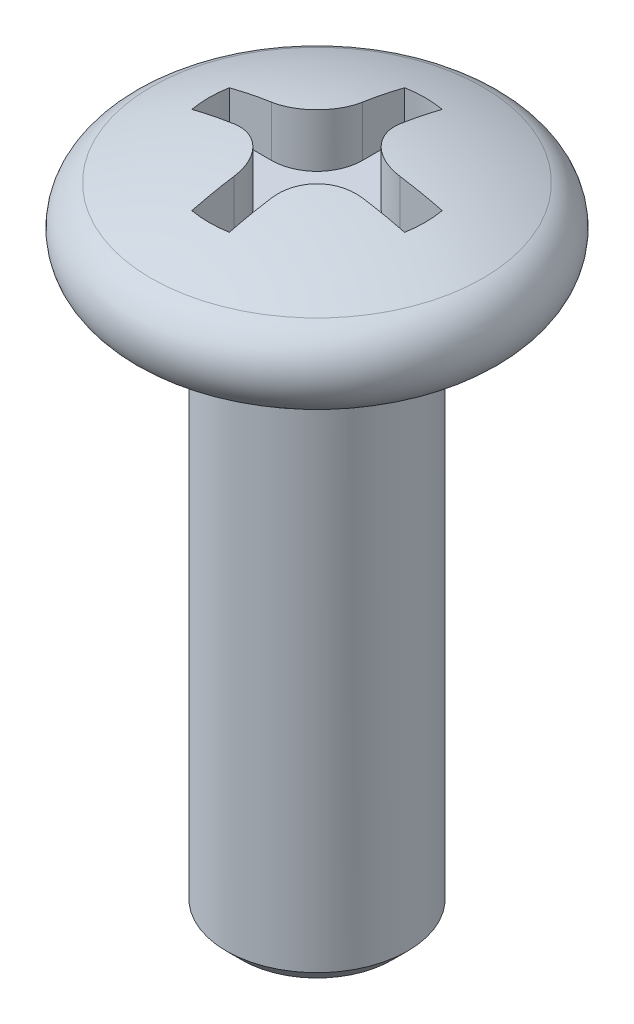
ISO-10303-21;
HEADER;
FILE_DESCRIPTION(('STEP AP214'),'2;1');
FILE_NAME('part.step','',(''),(''),'','','');
FILE_SCHEMA(('AUTOMOTIVE_DESIGN { 1 0 10303 214 1 1 1 1 }'));
ENDSEC;
DATA;
#1=APPLICATION_CONTEXT('core data for automotive mechanical design processes');
#2=APPLICATION_PROTOCOL_DEFINITION('international standard','automotive_design',2000,#1);
#3=PRODUCT_CONTEXT('',#1,'mechanical');
#4=PRODUCT('Part','Part','',(#3));
#5=PRODUCT_RELATED_PRODUCT_CATEGORY('part','',(#4));
#6=PRODUCT_DEFINITION_FORMATION('','',#4);
#7=PRODUCT_DEFINITION_CONTEXT('part definition',#1,'design');
#8=PRODUCT_DEFINITION('design','',#6,#7);
#9=PRODUCT_DEFINITION_SHAPE('','',#8);
#10=(LENGTH_UNIT() NAMED_UNIT(*) SI_UNIT(.MILLI.,.METRE.));
#11=(NAMED_UNIT(*) PLANE_ANGLE_UNIT() SI_UNIT($,.RADIAN.));
#12=(NAMED_UNIT(*) SI_UNIT($,.STERADIAN.) SOLID_ANGLE_UNIT());
#13=UNCERTAINTY_MEASURE_WITH_UNIT(LENGTH_MEASURE(1.E-05),#10,'distance_accuracy_value','');
#14=(GEOMETRIC_REPRESENTATION_CONTEXT(3) GLOBAL_UNCERTAINTY_ASSIGNED_CONTEXT((#13)) GLOBAL_UNIT_ASSIGNED_CONTEXT((#10,
#11,#12)) REPRESENTATION_CONTEXT('',''));
#15=CARTESIAN_POINT('',(0.,0.,0.));
#16=DIRECTION('',(0.,0.,1.));
#17=DIRECTION('',(1.,0.,0.));
#18=AXIS2_PLACEMENT_3D('',#15,#16,#17);
#19=CARTESIAN_POINT('',(0.,0.8,0.));
#20=DIRECTION('',(0.,-1.,0.));
#21=DIRECTION('',(0.,0.,-1.));
#22=AXIS2_PLACEMENT_3D('',#19,#20,#21);
#23=PLANE('',#22);
#24=DIRECTION('',(0.,0.,1.));
#25=VECTOR('',#24,1.);
#26=CARTESIAN_POINT('',(-0.2692388155425,0.8,1.526437178598));
#27=LINE('',#26,#25);
#28=CARTESIAN_POINT('',(-0.2692388155425,0.8,0.9192388155425));
#29=VERTEX_POINT('',#28);
#30=CARTESIAN_POINT('',(-0.2692388155425,0.8,1.52643732965034));
#31=VERTEX_POINT('',#30);
#32=EDGE_CURVE('E160',#29,#31,#27,.T.);
#33=ORIENTED_EDGE('',*,*,#32,.T.);
#34=CARTESIAN_POINT('',(0.,0.8,0.));
#35=DIRECTION('',(0.,-1.,0.));
#36=DIRECTION('',(0.,0.,-1.));
#37=AXIS2_PLACEMENT_3D('',#34,#35,#36);
#38=CIRCLE('',#37,1.55);
#39=CARTESIAN_POINT('',(0.269238815542473,0.8,1.52643717859769));
#40=VERTEX_POINT('',#39);
#41=EDGE_CURVE('E239',#31,#40,#38,.F.);
#42=ORIENTED_EDGE('',*,*,#41,.T.);
#43=DIRECTION('',(0.,0.,-1.));
#44=VECTOR('',#43,1.);
#45=CARTESIAN_POINT('',(0.2692388155425,0.8,0.9192388155425));
#46=LINE('',#45,#44);
#47=CARTESIAN_POINT('',(0.2692388155425,0.8,0.9192388155425));
#48=VERTEX_POINT('',#47);
#49=EDGE_CURVE('E164',#40,#48,#46,.T.);
#50=ORIENTED_EDGE('',*,*,#49,.T.);
#51=CARTESIAN_POINT('',(0.9192388155425,0.8,0.9192388155425));
#52=DIRECTION('',(0.,-1.,0.));
#53=DIRECTION('',(0.,0.,-1.));
#54=AXIS2_PLACEMENT_3D('',#51,#52,#53);
#55=CIRCLE('',#54,0.65);
#56=CARTESIAN_POINT('',(0.9192388155425,0.8,0.2692388155425));
#57=VERTEX_POINT('',#56);
#58=EDGE_CURVE('E167',#57,#48,#55,.F.);
#59=ORIENTED_EDGE('',*,*,#58,.F.);
#60=DIRECTION('',(1.,0.,0.));
#61=VECTOR('',#60,1.);
#62=CARTESIAN_POINT('',(1.526437178598,0.8,0.2692388155425));
#63=LINE('',#62,#61);
#64=CARTESIAN_POINT('',(1.52643725449384,0.8,0.2692388155425));
#65=VERTEX_POINT('',#64);
#66=EDGE_CURVE('E168',#57,#65,#63,.T.);
#67=ORIENTED_EDGE('',*,*,#66,.T.);
#68=CARTESIAN_POINT('',(0.,0.8,0.));
#69=DIRECTION('',(0.,-1.,0.));
#70=DIRECTION('',(0.,0.,-1.));
#71=AXIS2_PLACEMENT_3D('',#68,#69,#70);
#72=CIRCLE('',#71,1.55);
#73=CARTESIAN_POINT('',(1.52643717859769,0.8,-0.269238815542473));
#74=VERTEX_POINT('',#73);
#75=EDGE_CURVE('E250',#65,#74,#72,.F.);
#76=ORIENTED_EDGE('',*,*,#75,.T.);
#77=DIRECTION('',(-1.,0.,0.));
#78=VECTOR('',#77,1.);
#79=CARTESIAN_POINT('',(0.9192388155425,0.8,-0.2692388155425));
#80=LINE('',#79,#78);
#81=CARTESIAN_POINT('',(0.9192388155425,0.8,-0.2692388155425));
#82=VERTEX_POINT('',#81);
#83=EDGE_CURVE('E173',#74,#82,#80,.T.);
#84=ORIENTED_EDGE('',*,*,#83,.T.);
#85=CARTESIAN_POINT('',(0.9192388155425,0.8,-0.9192388155425));
#86=DIRECTION('',(0.,-1.,0.));
#87=DIRECTION('',(0.,0.,-1.));
#88=AXIS2_PLACEMENT_3D('',#85,#86,#87);
#89=CIRCLE('',#88,0.65);
#90=CARTESIAN_POINT('',(0.2692388155425,0.8,-0.9192388155425));
#91=VERTEX_POINT('',#90);
#92=EDGE_CURVE('E176',#91,#82,#89,.F.);
#93=ORIENTED_EDGE('',*,*,#92,.F.);
#94=DIRECTION('',(0.,0.,-1.));
#95=VECTOR('',#94,1.);
#96=CARTESIAN_POINT('',(0.2692388155425,0.8,-1.526437178598));
#97=LINE('',#96,#95);
#98=CARTESIAN_POINT('',(0.2692388155425,0.8,-1.52643732965034));
#99=VERTEX_POINT('',#98);
#100=EDGE_CURVE('E178',#91,#99,#97,.T.);
#101=ORIENTED_EDGE('',*,*,#100,.T.);
#102=CARTESIAN_POINT('',(0.,0.8,0.));
#103=DIRECTION('',(0.,-1.,0.));
#104=DIRECTION('',(0.,0.,-1.));
#105=AXIS2_PLACEMENT_3D('',#102,#103,#104);
#106=CIRCLE('',#105,1.55);
#107=CARTESIAN_POINT('',(-0.269238815542474,0.8,-1.52643717859769));
#108=VERTEX_POINT('',#107);
#109=EDGE_CURVE('E136',#99,#108,#106,.F.);
#110=ORIENTED_EDGE('',*,*,#109,.T.);
#111=DIRECTION('',(0.,0.,1.));
#112=VECTOR('',#111,1.);
#113=CARTESIAN_POINT('',(-0.2692388155425,0.8,-0.9192388155425));
#114=LINE('',#113,#112);
#115=CARTESIAN_POINT('',(-0.2692388155425,0.8,-0.9192388155425));
#116=VERTEX_POINT('',#115);
#117=EDGE_CURVE('E132',#108,#116,#114,.T.);
#118=ORIENTED_EDGE('',*,*,#117,.T.);
#119=CARTESIAN_POINT('',(-0.9192388155425,0.8,-0.9192388155425));
#120=DIRECTION('',(0.,-1.,0.));
#121=DIRECTION('',(0.,0.,-1.));
#122=AXIS2_PLACEMENT_3D('',#119,#120,#121);
#123=CIRCLE('',#122,0.65);
#124=CARTESIAN_POINT('',(-0.9192388155425,0.8,-0.2692388155425));
#125=VERTEX_POINT('',#124);
#126=EDGE_CURVE('E19',#125,#116,#123,.F.);
#127=ORIENTED_EDGE('',*,*,#126,.F.);
#128=DIRECTION('',(-1.,0.,0.));
#129=VECTOR('',#128,1.);
#130=CARTESIAN_POINT('',(-1.526437178598,0.8,-0.2692388155425));
#131=LINE('',#130,#129);
#132=CARTESIAN_POINT('',(-1.5264371785977,0.8,-0.269238815542425));
#133=VERTEX_POINT('',#132);
#134=EDGE_CURVE('E127',#125,#133,#131,.T.);
#135=ORIENTED_EDGE('',*,*,#134,.T.);
#136=CARTESIAN_POINT('',(0.,0.8,0.));
#137=DIRECTION('',(0.,-1.,0.));
#138=DIRECTION('',(0.,0.,-1.));
#139=AXIS2_PLACEMENT_3D('',#136,#137,#138);
#140=CIRCLE('',#139,1.55);
#141=CARTESIAN_POINT('',(-1.52643717859784,0.8,0.2692388155425));
#142=VERTEX_POINT('',#141);
#143=EDGE_CURVE('E247',#133,#142,#140,.F.);
#144=ORIENTED_EDGE('',*,*,#143,.T.);
#145=DIRECTION('',(1.,0.,0.));
#146=VECTOR('',#145,1.);
#147=CARTESIAN_POINT('',(-0.9192388155425,0.8,0.2692388155425));
#148=LINE('',#147,#146);
#149=CARTESIAN_POINT('',(-0.9192388155425,0.8,0.2692388155425));
#150=VERTEX_POINT('',#149);
#151=EDGE_CURVE('E157',#142,#150,#148,.T.);
#152=ORIENTED_EDGE('',*,*,#151,.T.);
#153=CARTESIAN_POINT('',(-0.9192388155425,0.8,0.9192388155425));
#154=DIRECTION('',(0.,-1.,0.));
#155=DIRECTION('',(0.,0.,-1.));
#156=AXIS2_PLACEMENT_3D('',#153,#154,#155);
#157=CIRCLE('',#156,0.65);
#158=EDGE_CURVE('E233',#29,#150,#157,.F.);
#159=ORIENTED_EDGE('',*,*,#158,.F.);
#160=EDGE_LOOP('',(#33,#42,#50,#59,#67,#76,#84,#93,#101,#110,#118,#127,#135,#144,#152,#159));
#161=FACE_BOUND('',#160,.T.);
#162=ADVANCED_FACE('F16',(#161),#23,.F.);
#163=CARTESIAN_POINT('',(-1.526437178598,0.8,-0.2692388155425));
#164=DIRECTION('',(0.,0.,-1.));
#165=DIRECTION('',(-1.,0.,0.));
#166=AXIS2_PLACEMENT_3D('',#163,#164,#165);
#167=PLANE('',#166);
#168=ORIENTED_EDGE('',*,*,#134,.F.);
#169=DIRECTION('',(0.,-1.,0.));
#170=VECTOR('',#169,1.);
#171=CARTESIAN_POINT('',(-0.9192388155425,0.8,-0.2692388155425));
#172=LINE('',#171,#170);
#173=CARTESIAN_POINT('',(-0.919238815542485,1.5247137721749,-0.269238815542501));
#174=VERTEX_POINT('',#173);
#175=EDGE_CURVE('E146',#174,#125,#172,.T.);
#176=ORIENTED_EDGE('',*,*,#175,.F.);
#177=CARTESIAN_POINT('',(-1.52643717859785,1.40083405534686,-0.269238815542502));
#178=CARTESIAN_POINT('',(-1.42628258533272,1.42660341497324,-0.269238815542501));
#179=CARTESIAN_POINT('',(-1.32560542511221,1.44981140452209,-0.2692388155425));
#180=CARTESIAN_POINT('',(-1.12320597076041,1.49110464346474,-0.2692388155425));
#181=CARTESIAN_POINT('',(-1.02148367662913,1.50918989285854,-0.269238815542501));
#182=CARTESIAN_POINT('',(-0.919238815542471,1.52471377217481,-0.269238815542503));
#183=B_SPLINE_CURVE_WITH_KNOTS('',3,(#177,#178,#179,#180,#181,#182),.UNSPECIFIED.,.F.,.F.,(4,2,
4),(0.,0.309952435577942,0.619904871155884),.UNSPECIFIED.);
#184=CARTESIAN_POINT('',(-1.52643717859778,1.40083405534693,-0.269238815542426));
#185=VERTEX_POINT('',#184);
#186=EDGE_CURVE('E230',#185,#174,#183,.T.);
#187=ORIENTED_EDGE('',*,*,#186,.F.);
#188=DIRECTION('',(0.,-1.,0.));
#189=VECTOR('',#188,1.);
#190=CARTESIAN_POINT('',(-1.52643717859772,0.8,-0.269238815542349));
#191=LINE('',#190,#189);
#192=EDGE_CURVE('E245',#185,#133,#191,.T.);
#193=ORIENTED_EDGE('',*,*,#192,.T.);
#194=EDGE_LOOP('',(#168,#176,#187,#193));
#195=FACE_BOUND('',#194,.T.);
#196=ADVANCED_FACE('F290',(#195),#167,.F.);
#197=CARTESIAN_POINT('',(-0.9192388155425,0.8,-0.9192388155425));
#198=DIRECTION('',(0.,-1.,0.));
#199=DIRECTION('',(0.,0.,-1.));
#200=AXIS2_PLACEMENT_3D('',#197,#198,#199);
#201=CYLINDRICAL_SURFACE('',#200,0.65);
#202=DIRECTION('',(0.,1.,0.));
#203=VECTOR('',#202,1.);
#204=CARTESIAN_POINT('',(-0.2692388155425,0.8,-0.9192388155425));
#205=LINE('',#204,#203);
#206=CARTESIAN_POINT('',(-0.269238815542499,1.5247137721749,-0.9192388155425));
#207=VERTEX_POINT('',#206);
#208=EDGE_CURVE('E140',#116,#207,#205,.T.);
#209=ORIENTED_EDGE('',*,*,#208,.T.);
#210=CARTESIAN_POINT('',(-0.919238815542471,1.52471377217481,-0.269238815542502));
#211=CARTESIAN_POINT('',(-0.883271069284547,1.53017838215662,-0.269206596368221));
#212=CARTESIAN_POINT('',(-0.847230957030022,1.53518398680924,-0.272222835690411));
#213=CARTESIAN_POINT('',(-0.776024482266567,1.54415362187526,-0.284194183766013));
#214=CARTESIAN_POINT('',(-0.740857976412674,1.5481178242021,-0.293148311438722));
#215=CARTESIAN_POINT('',(-0.67237147630745,1.55488625546089,-0.316848960302737));
#216=CARTESIAN_POINT('',(-0.639053304502208,1.55768935656103,-0.331601086387425));
#217=CARTESIAN_POINT('',(-0.575297778798748,1.56204492956572,-0.366496760027211));
#218=CARTESIAN_POINT('',(-0.544859240050173,1.56359791783258,-0.386638076978003));
#219=CARTESIAN_POINT('',(-0.488097063461274,1.56539571440067,-0.431479043245953));
#220=CARTESIAN_POINT('',(-0.46172860298219,1.56565593228317,-0.456121349806758));
#221=CARTESIAN_POINT('',(-0.413435525795813,1.56490196217992,-0.509414647326526));
#222=CARTESIAN_POINT('',(-0.391510799474461,1.56388780563375,-0.538065539375813));
#223=CARTESIAN_POINT('',(-0.352825154531402,1.56062536432746,-0.598376464130783));
#224=CARTESIAN_POINT('',(-0.33603703253758,1.55838376285363,-0.630019440211363));
#225=CARTESIAN_POINT('',(-0.307904881496572,1.55273696196925,-0.69554063304805));
#226=CARTESIAN_POINT('',(-0.296559537832556,1.54933204387991,-0.729418307797173));
#227=CARTESIAN_POINT('',(-0.281799832125994,1.54249219211062,-0.789390970708275));
#228=CARTESIAN_POINT('',(-0.277087023520738,1.53929822937966,-0.815202930682549));
#229=CARTESIAN_POINT('',(-0.270805742102409,1.53238664939424,-0.867099473917435));
#230=CARTESIAN_POINT('',(-0.269232761212042,1.52866979112439,-0.893183612184108));
#231=CARTESIAN_POINT('',(-0.269238815542499,1.5247137721748,-0.919238815542471));
#232=B_SPLINE_CURVE_WITH_KNOTS('',3,(#210,#211,#212,#213,#214,#215,#216,#217,#218,#219,#220,
#221,#222,#223,#224,#225,#226,#227,#228,#229,#230,#231),.UNSPECIFIED.,.F.,.F.,(4,2,2,2,2,2,2,2,
2,2,4),(0.,0.109017930799935,0.218017853725243,0.327123406477721,0.436183869743588,
0.543941180487167,0.651695832846214,0.758869525629321,0.866017319256542,0.945129051904781,
1.02412711619082),.UNSPECIFIED.);
#233=EDGE_CURVE('E272',#174,#207,#232,.T.);
#234=ORIENTED_EDGE('',*,*,#233,.F.);
#235=ORIENTED_EDGE('',*,*,#175,.T.);
#236=ORIENTED_EDGE('',*,*,#126,.T.);
#237=EDGE_LOOP('',(#209,#234,#235,#236));
#238=FACE_BOUND('',#237,.T.);
#239=ADVANCED_FACE('F143',(#238),#201,.T.);
#240=CARTESIAN_POINT('',(-0.2692388155425,0.8,-0.9192388155425));
#241=DIRECTION('',(-1.,0.,0.));
#242=DIRECTION('',(0.,0.,1.));
#243=AXIS2_PLACEMENT_3D('',#240,#241,#242);
#244=PLANE('',#243);
#245=ORIENTED_EDGE('',*,*,#117,.F.);
#246=DIRECTION('',(0.,-1.,0.));
#247=VECTOR('',#246,1.);
#248=CARTESIAN_POINT('',(-0.269238815542447,0.8,-1.5264371785977));
#249=LINE('',#248,#247);
#250=CARTESIAN_POINT('',(-0.269238815542499,1.40083405534695,-1.5264371785976));
#251=VERTEX_POINT('',#250);
#252=EDGE_CURVE('E152',#108,#251,#249,.F.);
#253=ORIENTED_EDGE('',*,*,#252,.T.);
#254=CARTESIAN_POINT('',(-0.269238815542499,-4.530985590341,0.));
#255=DIRECTION('',(-1.,0.,0.));
#256=DIRECTION('',(0.,0.,1.));
#257=AXIS2_PLACEMENT_3D('',#254,#255,#256);
#258=CIRCLE('',#257,6.12507100115372);
#259=EDGE_CURVE('E149',#207,#251,#258,.T.);
#260=ORIENTED_EDGE('',*,*,#259,.F.);
#261=ORIENTED_EDGE('',*,*,#208,.F.);
#262=EDGE_LOOP('',(#245,#253,#260,#261));
#263=FACE_BOUND('',#262,.T.);
#264=ADVANCED_FACE('F147',(#263),#244,.F.);
#265=CARTESIAN_POINT('',(0.,0.8,0.));
#266=DIRECTION('',(0.,-1.,0.));
#267=DIRECTION('',(0.,0.,-1.));
#268=AXIS2_PLACEMENT_3D('',#265,#266,#267);
#269=CYLINDRICAL_SURFACE('',#268,1.55);
#270=ORIENTED_EDGE('',*,*,#109,.F.);
#271=DIRECTION('',(0.,1.,0.));
#272=VECTOR('',#271,1.);
#273=CARTESIAN_POINT('',(0.2692388155425,0.8,-1.526437480703));
#274=LINE('',#273,#272);
#275=CARTESIAN_POINT('',(0.2692388155425,1.40083401647652,-1.52643732965025));
#276=VERTEX_POINT('',#275);
#277=EDGE_CURVE('E179',#99,#276,#274,.T.);
#278=ORIENTED_EDGE('',*,*,#277,.T.);
#279=CARTESIAN_POINT('',(0.,1.400834055347,0.));
#280=DIRECTION('',(0.,-1.,0.));
#281=DIRECTION('',(0.,0.,-1.));
#282=AXIS2_PLACEMENT_3D('',#279,#280,#281);
#283=CIRCLE('',#282,1.55);
#284=EDGE_CURVE('E260',#251,#276,#283,.T.);
#285=ORIENTED_EDGE('',*,*,#284,.F.);
#286=ORIENTED_EDGE('',*,*,#252,.F.);
#287=EDGE_LOOP('',(#270,#278,#285,#286));
#288=FACE_BOUND('',#287,.T.);
#289=ADVANCED_FACE('F258',(#288),#269,.F.);
#290=CARTESIAN_POINT('',(0.2692388155425,0.8,-1.526437178598));
#291=DIRECTION('',(1.,0.,0.));
#292=DIRECTION('',(0.,0.,-1.));
#293=AXIS2_PLACEMENT_3D('',#290,#291,#292);
#294=PLANE('',#293);
#295=ORIENTED_EDGE('',*,*,#100,.F.);
#296=DIRECTION('',(0.,-1.,0.));
#297=VECTOR('',#296,1.);
#298=CARTESIAN_POINT('',(0.2692388155425,0.8,-0.9192388155425));
#299=LINE('',#298,#297);
#300=CARTESIAN_POINT('',(0.2692388155425,1.5247137721749,-0.9192388155425));
#301=VERTEX_POINT('',#300);
#302=EDGE_CURVE('E252',#301,#91,#299,.T.);
#303=ORIENTED_EDGE('',*,*,#302,.F.);
#304=CARTESIAN_POINT('',(0.2692388155425,-4.530985590341,0.));
#305=DIRECTION('',(-1.,0.,0.));
#306=DIRECTION('',(0.,0.,1.));
#307=AXIS2_PLACEMENT_3D('',#304,#305,#306);
#308=CIRCLE('',#307,6.12507100115372);
#309=EDGE_CURVE('E263',#276,#301,#308,.F.);
#310=ORIENTED_EDGE('',*,*,#309,.F.);
#311=ORIENTED_EDGE('',*,*,#277,.F.);
#312=EDGE_LOOP('',(#295,#303,#310,#311));
#313=FACE_BOUND('',#312,.T.);
#314=ADVANCED_FACE('F264',(#313),#294,.F.);
#315=CARTESIAN_POINT('',(0.9192388155425,0.8,-0.9192388155425));
#316=DIRECTION('',(0.,-1.,0.));
#317=DIRECTION('',(0.,0.,-1.));
#318=AXIS2_PLACEMENT_3D('',#315,#316,#317);
#319=CYLINDRICAL_SURFACE('',#318,0.65);
#320=DIRECTION('',(0.,1.,0.));
#321=VECTOR('',#320,1.);
#322=CARTESIAN_POINT('',(0.9192388155425,0.8,-0.2692388155425));
#323=LINE('',#322,#321);
#324=CARTESIAN_POINT('',(0.919238815542485,1.5247137721749,-0.269238815542501));
#325=VERTEX_POINT('',#324);
#326=EDGE_CURVE('E175',#82,#325,#323,.T.);
#327=ORIENTED_EDGE('',*,*,#326,.T.);
#328=CARTESIAN_POINT('',(0.2692388155425,1.5247137721748,-0.919238815542471));
#329=CARTESIAN_POINT('',(0.26920659636822,1.53017838215662,-0.883271069284549));
#330=CARTESIAN_POINT('',(0.27222283569041,1.53518398680924,-0.847230957030025));
#331=CARTESIAN_POINT('',(0.284194183766012,1.54415362187526,-0.776024482266574));
#332=CARTESIAN_POINT('',(0.29314831143872,1.5481178242021,-0.740857976412682));
#333=CARTESIAN_POINT('',(0.316848960302734,1.55488625546089,-0.672371476307461));
#334=CARTESIAN_POINT('',(0.33160108638742,1.55768935656103,-0.63905330450222));
#335=CARTESIAN_POINT('',(0.366496760027202,1.56204492956572,-0.575297778798761));
#336=CARTESIAN_POINT('',(0.386638076977991,1.56359791783258,-0.544859240050187));
#337=CARTESIAN_POINT('',(0.431479043245938,1.56539571440067,-0.488097063461288));
#338=CARTESIAN_POINT('',(0.456121349806743,1.56565593228317,-0.461728602982204));
#339=CARTESIAN_POINT('',(0.509414647326511,1.56490196217992,-0.413435525795826));
#340=CARTESIAN_POINT('',(0.538065539375799,1.56388780563376,-0.391510799474473));
#341=CARTESIAN_POINT('',(0.598376464130768,1.56062536432746,-0.352825154531412));
#342=CARTESIAN_POINT('',(0.630019440211347,1.55838376285363,-0.336037032537589));
#343=CARTESIAN_POINT('',(0.695540633048032,1.55273696196925,-0.307904881496577));
#344=CARTESIAN_POINT('',(0.729418307797154,1.54933204387992,-0.296559537832559));
#345=CARTESIAN_POINT('',(0.789390970708259,1.54249219211062,-0.281799832125995));
#346=CARTESIAN_POINT('',(0.815202930682536,1.53929822937967,-0.277087023520739));
#347=CARTESIAN_POINT('',(0.867099473917428,1.53238664939424,-0.270805742102411));
#348=CARTESIAN_POINT('',(0.893183612184104,1.52866979112439,-0.269232761212043));
#349=CARTESIAN_POINT('',(0.91923881554247,1.52471377217481,-0.269238815542501));
#350=B_SPLINE_CURVE_WITH_KNOTS('',3,(#328,#329,#330,#331,#332,#333,#334,#335,#336,#337,#338,
#339,#340,#341,#342,#343,#344,#345,#346,#347,#348,#349),.UNSPECIFIED.,.F.,.F.,(4,2,2,2,2,2,2,2,
2,2,4),(0.,0.10901793079993,0.218017853725233,0.327123406477707,0.436183869743568,
0.543941180487147,0.651695832846195,0.758869525629303,0.866017319256523,0.945129051904771,
1.02412711619082),.UNSPECIFIED.);
#351=EDGE_CURVE('E268',#301,#325,#350,.T.);
#352=ORIENTED_EDGE('',*,*,#351,.F.);
#353=ORIENTED_EDGE('',*,*,#302,.T.);
#354=ORIENTED_EDGE('',*,*,#92,.T.);
#355=EDGE_LOOP('',(#327,#352,#353,#354));
#356=FACE_BOUND('',#355,.T.);
#357=ADVANCED_FACE('F409',(#356),#319,.T.);
#358=CARTESIAN_POINT('',(0.9192388155425,0.8,-0.2692388155425));
#359=DIRECTION('',(0.,0.,-1.));
#360=DIRECTION('',(-1.,0.,0.));
#361=AXIS2_PLACEMENT_3D('',#358,#359,#360);
#362=PLANE('',#361);
#363=ORIENTED_EDGE('',*,*,#83,.F.);
#364=DIRECTION('',(0.,-1.,0.));
#365=VECTOR('',#364,1.);
#366=CARTESIAN_POINT('',(1.5264371785977,0.8,-0.269238815542447));
#367=LINE('',#366,#365);
#368=CARTESIAN_POINT('',(1.52643717859769,1.400834055347,-0.269238815542473));
#369=VERTEX_POINT('',#368);
#370=EDGE_CURVE('E172',#74,#369,#367,.F.);
#371=ORIENTED_EDGE('',*,*,#370,.T.);
#372=CARTESIAN_POINT('',(0.91923881554247,1.52471377217481,-0.269238815542502));
#373=CARTESIAN_POINT('',(1.02148367662913,1.50918989285854,-0.269238815542501));
#374=CARTESIAN_POINT('',(1.12320597076041,1.49110464346474,-0.2692388155425));
#375=CARTESIAN_POINT('',(1.3256054251122,1.44981140452209,-0.2692388155425));
#376=CARTESIAN_POINT('',(1.42628258533271,1.42660341497324,-0.269238815542501));
#377=CARTESIAN_POINT('',(1.52643717859784,1.40083405534686,-0.269238815542503));
#378=B_SPLINE_CURVE_WITH_KNOTS('',3,(#372,#373,#374,#375,#376,#377),.UNSPECIFIED.,.F.,.F.,(4,2,
4),(0.,0.309952435577938,0.619904871155877),.UNSPECIFIED.);
#379=EDGE_CURVE('E516',#325,#369,#378,.T.);
#380=ORIENTED_EDGE('',*,*,#379,.F.);
#381=ORIENTED_EDGE('',*,*,#326,.F.);
#382=EDGE_LOOP('',(#363,#371,#380,#381));
#383=FACE_BOUND('',#382,.T.);
#384=ADVANCED_FACE('F401',(#383),#362,.F.);
#385=CARTESIAN_POINT('',(0.,0.8,0.));
#386=DIRECTION('',(0.,-1.,0.));
#387=DIRECTION('',(0.,0.,-1.));
#388=AXIS2_PLACEMENT_3D('',#385,#386,#387);
#389=CYLINDRICAL_SURFACE('',#388,1.55);
#390=ORIENTED_EDGE('',*,*,#143,.F.);
#391=ORIENTED_EDGE('',*,*,#192,.F.);
#392=CARTESIAN_POINT('',(0.,1.400834055347,0.));
#393=DIRECTION('',(0.,-1.,0.));
#394=DIRECTION('',(0.,0.,-1.));
#395=AXIS2_PLACEMENT_3D('',#392,#393,#394);
#396=CIRCLE('',#395,1.55);
#397=CARTESIAN_POINT('',(-1.52643717859784,1.400834055347,0.2692388155425));
#398=VERTEX_POINT('',#397);
#399=EDGE_CURVE('E523',#398,#185,#396,.T.);
#400=ORIENTED_EDGE('',*,*,#399,.F.);
#401=DIRECTION('',(0.,1.,0.));
#402=VECTOR('',#401,1.);
#403=CARTESIAN_POINT('',(-1.526437178598,0.8,0.2692388155425));
#404=LINE('',#403,#402);
#405=EDGE_CURVE('E159',#398,#142,#404,.F.);
#406=ORIENTED_EDGE('',*,*,#405,.T.);
#407=EDGE_LOOP('',(#390,#391,#400,#406));
#408=FACE_BOUND('',#407,.T.);
#409=ADVANCED_FACE('F393',(#408),#389,.F.);
#410=CARTESIAN_POINT('',(0.,0.8,0.));
#411=DIRECTION('',(0.,-1.,0.));
#412=DIRECTION('',(0.,0.,-1.));
#413=AXIS2_PLACEMENT_3D('',#410,#411,#412);
#414=CYLINDRICAL_SURFACE('',#413,1.55);
#415=ORIENTED_EDGE('',*,*,#370,.F.);
#416=ORIENTED_EDGE('',*,*,#75,.F.);
#417=DIRECTION('',(0.,1.,0.));
#418=VECTOR('',#417,1.);
#419=CARTESIAN_POINT('',(1.52643733039,0.8,0.2692388155425));
#420=LINE('',#419,#418);
#421=CARTESIAN_POINT('',(1.52643725449395,1.40083405534692,0.2692388155425));
#422=VERTEX_POINT('',#421);
#423=EDGE_CURVE('E171',#65,#422,#420,.T.);
#424=ORIENTED_EDGE('',*,*,#423,.T.);
#425=CARTESIAN_POINT('',(0.,1.400834055347,0.));
#426=DIRECTION('',(0.,-1.,0.));
#427=DIRECTION('',(0.,0.,-1.));
#428=AXIS2_PLACEMENT_3D('',#425,#426,#427);
#429=CIRCLE('',#428,1.55);
#430=EDGE_CURVE('E525',#369,#422,#429,.T.);
#431=ORIENTED_EDGE('',*,*,#430,.F.);
#432=EDGE_LOOP('',(#415,#416,#424,#431));
#433=FACE_BOUND('',#432,.T.);
#434=ADVANCED_FACE('F385',(#433),#414,.F.);
#435=CARTESIAN_POINT('',(1.526437178598,0.8,0.2692388155425));
#436=DIRECTION('',(0.,0.,1.));
#437=DIRECTION('',(1.,0.,0.));
#438=AXIS2_PLACEMENT_3D('',#435,#436,#437);
#439=PLANE('',#438);
#440=ORIENTED_EDGE('',*,*,#66,.F.);
#441=DIRECTION('',(0.,-1.,0.));
#442=VECTOR('',#441,1.);
#443=CARTESIAN_POINT('',(0.9192388155425,0.8,0.2692388155425));
#444=LINE('',#443,#442);
#445=CARTESIAN_POINT('',(0.919238815542485,1.5247137721749,0.2692388155425));
#446=VERTEX_POINT('',#445);
#447=EDGE_CURVE('E241',#446,#57,#444,.T.);
#448=ORIENTED_EDGE('',*,*,#447,.F.);
#449=CARTESIAN_POINT('',(1.5264371785979,1.40083405534685,0.269238815542499));
#450=CARTESIAN_POINT('',(1.42628258533276,1.42660341497323,0.269238815542499));
#451=CARTESIAN_POINT('',(1.32560542511224,1.44981140452209,0.2692388155425));
#452=CARTESIAN_POINT('',(1.12320597076043,1.49110464346474,0.2692388155425));
#453=CARTESIAN_POINT('',(1.02148367662914,1.50918989285854,0.269238815542501));
#454=CARTESIAN_POINT('',(0.919238815542471,1.52471377217481,0.269238815542501));
#455=B_SPLINE_CURVE_WITH_KNOTS('',3,(#449,#450,#451,#452,#453,#454),.UNSPECIFIED.,.F.,.F.,(4,2,
4),(0.,0.309952435577968,0.619904871155937),.UNSPECIFIED.);
#456=EDGE_CURVE('E527',#422,#446,#455,.T.);
#457=ORIENTED_EDGE('',*,*,#456,.F.);
#458=ORIENTED_EDGE('',*,*,#423,.F.);
#459=EDGE_LOOP('',(#440,#448,#457,#458));
#460=FACE_BOUND('',#459,.T.);
#461=ADVANCED_FACE('F377',(#460),#439,.F.);
#462=CARTESIAN_POINT('',(0.9192388155425,0.8,0.9192388155425));
#463=DIRECTION('',(0.,-1.,0.));
#464=DIRECTION('',(0.,0.,-1.));
#465=AXIS2_PLACEMENT_3D('',#462,#463,#464);
#466=CYLINDRICAL_SURFACE('',#465,0.65);
#467=DIRECTION('',(0.,1.,0.));
#468=VECTOR('',#467,1.);
#469=CARTESIAN_POINT('',(0.2692388155425,0.8,0.9192388155425));
#470=LINE('',#469,#468);
#471=CARTESIAN_POINT('',(0.2692388155425,1.5247137721749,0.919238815542486));
#472=VERTEX_POINT('',#471);
#473=EDGE_CURVE('E166',#48,#472,#470,.T.);
#474=ORIENTED_EDGE('',*,*,#473,.T.);
#475=CARTESIAN_POINT('',(0.919238815542471,1.52471377217481,0.269238815542501));
#476=CARTESIAN_POINT('',(0.88327106928455,1.53017838215662,0.26920659636822));
#477=CARTESIAN_POINT('',(0.847230957030028,1.53518398680924,0.27222283569041));
#478=CARTESIAN_POINT('',(0.776024482266579,1.54415362187526,0.284194183766011));
#479=CARTESIAN_POINT('',(0.740857976412689,1.5481178242021,0.293148311438719));
#480=CARTESIAN_POINT('',(0.672371476307471,1.55488625546089,0.31684896030273));
#481=CARTESIAN_POINT('',(0.639053304502231,1.55768935656103,0.331601086387414));
#482=CARTESIAN_POINT('',(0.575297778798774,1.56204492956572,0.366496760027194));
#483=CARTESIAN_POINT('',(0.544859240050202,1.56359791783258,0.386638076977983));
#484=CARTESIAN_POINT('',(0.488097063461302,1.56539571440067,0.431479043245928));
#485=CARTESIAN_POINT('',(0.461728602982216,1.56565593228317,0.456121349806731));
#486=CARTESIAN_POINT('',(0.413435525795836,1.56490196217992,0.509414647326497));
#487=CARTESIAN_POINT('',(0.391510799474484,1.56388780563376,0.538065539375785));
#488=CARTESIAN_POINT('',(0.352825154531421,1.56062536432746,0.598376464130753));
#489=CARTESIAN_POINT('',(0.336037032537596,1.55838376285363,0.630019440211331));
#490=CARTESIAN_POINT('',(0.307904881496584,1.55273696196925,0.695540633048016));
#491=CARTESIAN_POINT('',(0.296559537832567,1.54933204387992,0.729418307797139));
#492=CARTESIAN_POINT('',(0.281799832126,1.54249219211062,0.789390970708247));
#493=CARTESIAN_POINT('',(0.277087023520742,1.53929822937967,0.815202930682527));
#494=CARTESIAN_POINT('',(0.27080574210241,1.53238664939424,0.867099473917423));
#495=CARTESIAN_POINT('',(0.269232761212041,1.52866979112439,0.893183612184102));
#496=CARTESIAN_POINT('',(0.269238815542501,1.52471377217481,0.919238815542471));
#497=B_SPLINE_CURVE_WITH_KNOTS('',3,(#475,#476,#477,#478,#479,#480,#481,#482,#483,#484,#485,
#486,#487,#488,#489,#490,#491,#492,#493,#494,#495,#496),.UNSPECIFIED.,.F.,.F.,(4,2,2,2,2,2,2,2,
2,2,4),(0.,0.109017930799925,0.218017853725224,0.327123406477693,0.43618386974355,
0.543941180487129,0.651695832846177,0.758869525629285,0.866017319256506,0.945129051904763,
1.02412711619082),.UNSPECIFIED.);
#498=EDGE_CURVE('E534',#446,#472,#497,.T.);
#499=ORIENTED_EDGE('',*,*,#498,.F.);
#500=ORIENTED_EDGE('',*,*,#447,.T.);
#501=ORIENTED_EDGE('',*,*,#58,.T.);
#502=EDGE_LOOP('',(#474,#499,#500,#501));
#503=FACE_BOUND('',#502,.T.);
#504=ADVANCED_FACE('F369',(#503),#466,.T.);
#505=CARTESIAN_POINT('',(0.2692388155425,0.8,0.9192388155425));
#506=DIRECTION('',(1.,0.,0.));
#507=DIRECTION('',(0.,0.,-1.));
#508=AXIS2_PLACEMENT_3D('',#505,#506,#507);
#509=PLANE('',#508);
#510=ORIENTED_EDGE('',*,*,#49,.F.);
#511=DIRECTION('',(0.,-1.,0.));
#512=VECTOR('',#511,1.);
#513=CARTESIAN_POINT('',(0.269238815542447,0.8,1.5264371785977));
#514=LINE('',#513,#512);
#515=CARTESIAN_POINT('',(0.269238815542473,1.400834055347,1.52643717859769));
#516=VERTEX_POINT('',#515);
#517=EDGE_CURVE('E163',#40,#516,#514,.F.);
#518=ORIENTED_EDGE('',*,*,#517,.T.);
#519=CARTESIAN_POINT('',(0.269238815542501,1.52471377217481,0.919238815542471));
#520=CARTESIAN_POINT('',(0.269238815542502,1.50918989285854,1.02148367662913));
#521=CARTESIAN_POINT('',(0.269238815542502,1.49110464346474,1.12320597076041));
#522=CARTESIAN_POINT('',(0.269238815542498,1.44981140452209,1.3256054251122));
#523=CARTESIAN_POINT('',(0.269238815542496,1.42660341497324,1.42628258533271));
#524=CARTESIAN_POINT('',(0.269238815542491,1.40083405534687,1.52643717859784));
#525=B_SPLINE_CURVE_WITH_KNOTS('',3,(#519,#520,#521,#522,#523,#524),.UNSPECIFIED.,.F.,.F.,(4,2,
4),(0.,0.309952435577937,0.619904871155875),.UNSPECIFIED.);
#526=EDGE_CURVE('E543',#472,#516,#525,.T.);
#527=ORIENTED_EDGE('',*,*,#526,.F.);
#528=ORIENTED_EDGE('',*,*,#473,.F.);
#529=EDGE_LOOP('',(#510,#518,#527,#528));
#530=FACE_BOUND('',#529,.T.);
#531=ADVANCED_FACE('F361',(#530),#509,.F.);
#532=CARTESIAN_POINT('',(0.,0.8,0.));
#533=DIRECTION('',(0.,-1.,0.));
#534=DIRECTION('',(0.,0.,-1.));
#535=AXIS2_PLACEMENT_3D('',#532,#533,#534);
#536=CYLINDRICAL_SURFACE('',#535,1.55);
#537=ORIENTED_EDGE('',*,*,#41,.F.);
#538=DIRECTION('',(0.,1.,0.));
#539=VECTOR('',#538,1.);
#540=CARTESIAN_POINT('',(-0.2692388155425,0.8,1.526437480703));
#541=LINE('',#540,#539);
#542=CARTESIAN_POINT('',(-0.2692388155425,1.40083405534692,1.52643732965045));
#543=VERTEX_POINT('',#542);
#544=EDGE_CURVE('E162',#31,#543,#541,.T.);
#545=ORIENTED_EDGE('',*,*,#544,.T.);
#546=CARTESIAN_POINT('',(0.,1.400834055347,0.));
#547=DIRECTION('',(0.,-1.,0.));
#548=DIRECTION('',(0.,0.,-1.));
#549=AXIS2_PLACEMENT_3D('',#546,#547,#548);
#550=CIRCLE('',#549,1.55);
#551=EDGE_CURVE('E550',#516,#543,#550,.T.);
#552=ORIENTED_EDGE('',*,*,#551,.F.);
#553=ORIENTED_EDGE('',*,*,#517,.F.);
#554=EDGE_LOOP('',(#537,#545,#552,#553));
#555=FACE_BOUND('',#554,.T.);
#556=ADVANCED_FACE('F353',(#555),#536,.F.);
#557=CARTESIAN_POINT('',(-0.2692388155425,0.8,1.526437178598));
#558=DIRECTION('',(-1.,0.,0.));
#559=DIRECTION('',(0.,0.,1.));
#560=AXIS2_PLACEMENT_3D('',#557,#558,#559);
#561=PLANE('',#560);
#562=ORIENTED_EDGE('',*,*,#32,.F.);
#563=DIRECTION('',(0.,-1.,0.));
#564=VECTOR('',#563,1.);
#565=CARTESIAN_POINT('',(-0.2692388155425,0.8,0.9192388155425));
#566=LINE('',#565,#564);
#567=CARTESIAN_POINT('',(-0.2692388155425,1.5247137721749,0.919238815542485));
#568=VERTEX_POINT('',#567);
#569=EDGE_CURVE('E234',#568,#29,#566,.T.);
#570=ORIENTED_EDGE('',*,*,#569,.F.);
#571=CARTESIAN_POINT('',(-0.2692388155425,1.40083405534685,1.5264371785979));
#572=CARTESIAN_POINT('',(-0.2692388155425,1.42660341497323,1.42628258533276));
#573=CARTESIAN_POINT('',(-0.2692388155425,1.44981140452209,1.32560542511224));
#574=CARTESIAN_POINT('',(-0.2692388155425,1.49110464346474,1.12320597076043));
#575=CARTESIAN_POINT('',(-0.269238815542501,1.50918989285854,1.02148367662914));
#576=CARTESIAN_POINT('',(-0.269238815542502,1.5247137721748,0.919238815542469));
#577=B_SPLINE_CURVE_WITH_KNOTS('',3,(#571,#572,#573,#574,#575,#576),.UNSPECIFIED.,.F.,.F.,(4,2,
4),(0.,0.309952435577969,0.619904871155938),.UNSPECIFIED.);
#578=EDGE_CURVE('E552',#543,#568,#577,.T.);
#579=ORIENTED_EDGE('',*,*,#578,.F.);
#580=ORIENTED_EDGE('',*,*,#544,.F.);
#581=EDGE_LOOP('',(#562,#570,#579,#580));
#582=FACE_BOUND('',#581,.T.);
#583=ADVANCED_FACE('F347',(#582),#561,.F.);
#584=CARTESIAN_POINT('',(-0.9192388155425,0.8,0.9192388155425));
#585=DIRECTION('',(0.,-1.,0.));
#586=DIRECTION('',(0.,0.,-1.));
#587=AXIS2_PLACEMENT_3D('',#584,#585,#586);
#588=CYLINDRICAL_SURFACE('',#587,0.65);
#589=DIRECTION('',(0.,1.,0.));
#590=VECTOR('',#589,1.);
#591=CARTESIAN_POINT('',(-0.9192388155425,0.8,0.2692388155425));
#592=LINE('',#591,#590);
#593=CARTESIAN_POINT('',(-0.919238815542485,1.5247137721749,0.269238815542501));
#594=VERTEX_POINT('',#593);
#595=EDGE_CURVE('E34',#150,#594,#592,.T.);
#596=ORIENTED_EDGE('',*,*,#595,.T.);
#597=CARTESIAN_POINT('',(-0.2692388155425,1.5247137721748,0.919238815542471));
#598=CARTESIAN_POINT('',(-0.26920659636822,1.53017838215662,0.88327106928455));
#599=CARTESIAN_POINT('',(-0.27222283569041,1.53518398680924,0.847230957030028));
#600=CARTESIAN_POINT('',(-0.284194183766011,1.54415362187526,0.776024482266578));
#601=CARTESIAN_POINT('',(-0.293148311438719,1.5481178242021,0.740857976412687));
#602=CARTESIAN_POINT('',(-0.316848960302731,1.55488625546089,0.672371476307467));
#603=CARTESIAN_POINT('',(-0.331601086387417,1.55768935656103,0.639053304502226));
#604=CARTESIAN_POINT('',(-0.366496760027198,1.56204492956572,0.575297778798768));
#605=CARTESIAN_POINT('',(-0.386638076977987,1.56359791783258,0.544859240050195));
#606=CARTESIAN_POINT('',(-0.431479043245933,1.56539571440067,0.488097063461295));
#607=CARTESIAN_POINT('',(-0.456121349806737,1.56565593228317,0.46172860298221));
#608=CARTESIAN_POINT('',(-0.509414647326505,1.56490196217992,0.413435525795831));
#609=CARTESIAN_POINT('',(-0.538065539375792,1.56388780563376,0.391510799474478));
#610=CARTESIAN_POINT('',(-0.598376464130761,1.56062536432746,0.352825154531416));
#611=CARTESIAN_POINT('',(-0.630019440211339,1.55838376285363,0.336037032537591));
#612=CARTESIAN_POINT('',(-0.695540633048025,1.55273696196925,0.307904881496581));
#613=CARTESIAN_POINT('',(-0.729418307797148,1.54933204387992,0.296559537832564));
#614=CARTESIAN_POINT('',(-0.789390970708254,1.54249219211062,0.281799832125999));
#615=CARTESIAN_POINT('',(-0.815202930682532,1.53929822937967,0.277087023520741));
#616=CARTESIAN_POINT('',(-0.867099473917425,1.53238664939424,0.270805742102409));
#617=CARTESIAN_POINT('',(-0.893183612184102,1.52866979112439,0.269232761212041));
#618=CARTESIAN_POINT('',(-0.91923881554247,1.5247137721748,0.269238815542501));
#619=B_SPLINE_CURVE_WITH_KNOTS('',3,(#597,#598,#599,#600,#601,#602,#603,#604,#605,#606,#607,
#608,#609,#610,#611,#612,#613,#614,#615,#616,#617,#618),.UNSPECIFIED.,.F.,.F.,(4,2,2,2,2,2,2,2,
2,2,4),(0.,0.109017930799928,0.218017853725229,0.3271234064777,0.43618386974356,
0.543941180487139,0.651695832846188,0.758869525629295,0.866017319256516,0.945129051904768,
1.02412711619082),.UNSPECIFIED.);
#620=EDGE_CURVE('E201',#568,#594,#619,.T.);
#621=ORIENTED_EDGE('',*,*,#620,.F.);
#622=ORIENTED_EDGE('',*,*,#569,.T.);
#623=ORIENTED_EDGE('',*,*,#158,.T.);
#624=EDGE_LOOP('',(#596,#621,#622,#623));
#625=FACE_BOUND('',#624,.T.);
#626=ADVANCED_FACE('F340',(#625),#588,.T.);
#627=CARTESIAN_POINT('',(-0.9192388155425,0.8,0.2692388155425));
#628=DIRECTION('',(0.,0.,1.));
#629=DIRECTION('',(1.,0.,0.));
#630=AXIS2_PLACEMENT_3D('',#627,#628,#629);
#631=PLANE('',#630);
#632=ORIENTED_EDGE('',*,*,#151,.F.);
#633=ORIENTED_EDGE('',*,*,#405,.F.);
#634=CARTESIAN_POINT('',(-0.91923881554247,1.5247137721748,0.269238815542501));
#635=CARTESIAN_POINT('',(-1.02148367662914,1.50918989285854,0.2692388155425));
#636=CARTESIAN_POINT('',(-1.12320597076043,1.49110464346474,0.269238815542499));
#637=CARTESIAN_POINT('',(-1.32560542511224,1.44981140452209,0.269238815542501));
#638=CARTESIAN_POINT('',(-1.42628258533276,1.42660341497323,0.269238815542502));
#639=CARTESIAN_POINT('',(-1.5264371785979,1.40083405534685,0.269238815542504));
#640=B_SPLINE_CURVE_WITH_KNOTS('',3,(#634,#635,#636,#637,#638,#639),.UNSPECIFIED.,.F.,.F.,(4,2,
4),(0.,0.309952435577968,0.619904871155936),.UNSPECIFIED.);
#641=EDGE_CURVE('E192',#594,#398,#640,.T.);
#642=ORIENTED_EDGE('',*,*,#641,.F.);
#643=ORIENTED_EDGE('',*,*,#595,.F.);
#644=EDGE_LOOP('',(#632,#633,#642,#643));
#645=FACE_BOUND('',#644,.T.);
#646=ADVANCED_FACE('F208',(#645),#631,.F.);
#647=CARTESIAN_POINT('',(0.,-4.530985590341,0.));
#648=DIRECTION('',(0.967514856833645,-0.252814164567912,0.));
#649=DIRECTION('',(0.,0.,-1.));
#650=AXIS2_PLACEMENT_3D('',#647,#648,#649);
#651=SPHERICAL_SURFACE('',#650,6.130985590341);
#652=CARTESIAN_POINT('',(0.,1.12000000000007,0.));
#653=DIRECTION('',(0.,-1.,0.));
#654=DIRECTION('',(-1.,0.,0.));
#655=AXIS2_PLACEMENT_3D('',#652,#653,#654);
#656=CIRCLE('',#655,2.37809717352503);
#657=CARTESIAN_POINT('',(-2.37809717352503,1.12000000000007,0.));
#658=VERTEX_POINT('',#657);
#659=EDGE_CURVE('E189',#658,#658,#656,.T.);
#660=ORIENTED_EDGE('',*,*,#659,.F.);
#661=EDGE_LOOP('',(#660));
#662=FACE_BOUND('',#661,.T.);
#663=ORIENTED_EDGE('',*,*,#620,.T.);
#664=ORIENTED_EDGE('',*,*,#641,.T.);
#665=ORIENTED_EDGE('',*,*,#399,.T.);
#666=ORIENTED_EDGE('',*,*,#186,.T.);
#667=ORIENTED_EDGE('',*,*,#233,.T.);
#668=ORIENTED_EDGE('',*,*,#259,.T.);
#669=ORIENTED_EDGE('',*,*,#284,.T.);
#670=ORIENTED_EDGE('',*,*,#309,.T.);
#671=ORIENTED_EDGE('',*,*,#351,.T.);
#672=ORIENTED_EDGE('',*,*,#379,.T.);
#673=ORIENTED_EDGE('',*,*,#430,.T.);
#674=ORIENTED_EDGE('',*,*,#456,.T.);
#675=ORIENTED_EDGE('',*,*,#498,.T.);
#676=ORIENTED_EDGE('',*,*,#526,.T.);
#677=ORIENTED_EDGE('',*,*,#551,.T.);
#678=ORIENTED_EDGE('',*,*,#578,.T.);
#679=EDGE_LOOP('',(#663,#664,#665,#666,#667,#668,#669,#670,#671,#672,#673,#674,#675,#676,#677,#678));
#680=FACE_BOUND('',#679,.T.);
#681=ADVANCED_FACE('F211',(#662,#680),#651,.T.);
#682=CARTESIAN_POINT('',(0.,0.56,0.));
#683=DIRECTION('',(0.,-1.,0.));
#684=DIRECTION('',(-1.,0.,0.));
#685=AXIS2_PLACEMENT_3D('',#682,#683,#684);
#686=TOROIDAL_SURFACE('',#685,2.142433076372,0.6075669236282);
#687=CARTESIAN_POINT('',(0.,0.,0.));
#688=DIRECTION('',(0.,-1.,0.));
#689=DIRECTION('',(0.,0.,-1.));
#690=AXIS2_PLACEMENT_3D('',#687,#688,#689);
#691=CIRCLE('',#690,2.3780971735252);
#692=CARTESIAN_POINT('',(0.,0.,-2.3780971735252));
#693=VERTEX_POINT('',#692);
#694=EDGE_CURVE('E186',#693,#693,#691,.T.);
#695=ORIENTED_EDGE('',*,*,#694,.F.);
#696=EDGE_LOOP('',(#695));
#697=FACE_BOUND('',#696,.T.);
#698=ORIENTED_EDGE('',*,*,#659,.T.);
#699=EDGE_LOOP('',(#698));
#700=FACE_BOUND('',#699,.T.);
#701=ADVANCED_FACE('F216',(#697,#700),#686,.T.);
#702=CARTESIAN_POINT('',(0.,-8.,0.));
#703=DIRECTION('',(0.,-1.,0.));
#704=DIRECTION('',(0.,0.,-1.));
#705=AXIS2_PLACEMENT_3D('',#702,#703,#704);
#706=PLANE('',#705);
#707=CARTESIAN_POINT('',(0.,-7.99999999998136,0.));
#708=DIRECTION('',(0.,1.,0.));
#709=DIRECTION('',(0.,0.,1.));
#710=AXIS2_PLACEMENT_3D('',#707,#708,#709);
#711=CIRCLE('',#710,1.07500000001437);
#712=CARTESIAN_POINT('',(0.,-7.99999999998136,1.07500000001437));
#713=VERTEX_POINT('',#712);
#714=EDGE_CURVE('E183',#713,#713,#711,.T.);
#715=ORIENTED_EDGE('',*,*,#714,.F.);
#716=EDGE_LOOP('',(#715));
#717=FACE_BOUND('',#716,.T.);
#718=ADVANCED_FACE('F312',(#717),#706,.T.);
#719=CARTESIAN_POINT('',(0.,0.,0.));
#720=DIRECTION('',(0.,-1.,0.));
#721=DIRECTION('',(0.,0.,-1.));
#722=AXIS2_PLACEMENT_3D('',#719,#720,#721);
#723=PLANE('',#722);
#724=CARTESIAN_POINT('',(0.,0.,0.));
#725=DIRECTION('',(0.,-1.,0.));
#726=DIRECTION('',(0.,0.,-1.));
#727=AXIS2_PLACEMENT_3D('',#724,#725,#726);
#728=CIRCLE('',#727,1.3);
#729=CARTESIAN_POINT('',(0.,0.,-1.3));
#730=VERTEX_POINT('',#729);
#731=EDGE_CURVE('E25',#730,#730,#728,.T.);
#732=ORIENTED_EDGE('',*,*,#731,.F.);
#733=EDGE_LOOP('',(#732));
#734=FACE_BOUND('',#733,.T.);
#735=ORIENTED_EDGE('',*,*,#694,.T.);
#736=EDGE_LOOP('',(#735));
#737=FACE_BOUND('',#736,.T.);
#738=ADVANCED_FACE('F306',(#734,#737),#723,.T.);
#739=CARTESIAN_POINT('',(0.,-7.77499999998099,0.));
#740=DIRECTION('',(0.,1.,0.));
#741=DIRECTION('',(0.,0.,1.));
#742=AXIS2_PLACEMENT_3D('',#739,#740,#741);
#743=CONICAL_SURFACE('',#742,1.30000000001473,0.785398163397448);
#744=CARTESIAN_POINT('',(0.,-7.775,0.));
#745=DIRECTION('',(0.,-1.,0.));
#746=DIRECTION('',(0.,0.,-1.));
#747=AXIS2_PLACEMENT_3D('',#744,#745,#746);
#748=CIRCLE('',#747,1.3);
#749=CARTESIAN_POINT('',(0.,-7.775,-1.3));
#750=VERTEX_POINT('',#749);
#751=EDGE_CURVE('E11',#750,#750,#748,.F.);
#752=ORIENTED_EDGE('',*,*,#751,.F.);
#753=EDGE_LOOP('',(#752));
#754=FACE_BOUND('',#753,.T.);
#755=ORIENTED_EDGE('',*,*,#714,.T.);
#756=EDGE_LOOP('',(#755));
#757=FACE_BOUND('',#756,.T.);
#758=ADVANCED_FACE('F300',(#754,#757),#743,.T.);
#759=CARTESIAN_POINT('',(0.,2.08,0.));
#760=DIRECTION('',(0.,-1.,0.));
#761=DIRECTION('',(0.,0.,-1.));
#762=AXIS2_PLACEMENT_3D('',#759,#760,#761);
#763=CYLINDRICAL_SURFACE('',#762,1.3);
#764=ORIENTED_EDGE('',*,*,#731,.T.);
#765=EDGE_LOOP('',(#764));
#766=FACE_BOUND('',#765,.T.);
#767=ORIENTED_EDGE('',*,*,#751,.T.);
#768=EDGE_LOOP('',(#767));
#769=FACE_BOUND('',#768,.T.);
#770=ADVANCED_FACE('F298',(#766,#769),#763,.T.);
#771=CLOSED_SHELL('',(#162,#196,#239,#264,#289,#314,#357,#384,#409,#434,#461,#504,#531,#556,
#583,#626,#646,#681,#701,#718,#738,#758,#770));
#772=MANIFOLD_SOLID_BREP('B1',#771);
#773=ADVANCED_BREP_SHAPE_REPRESENTATION('',(#18,#772),#14);
#774=SHAPE_DEFINITION_REPRESENTATION(#9,#773);
ENDSEC;
END-ISO-10303-21;
